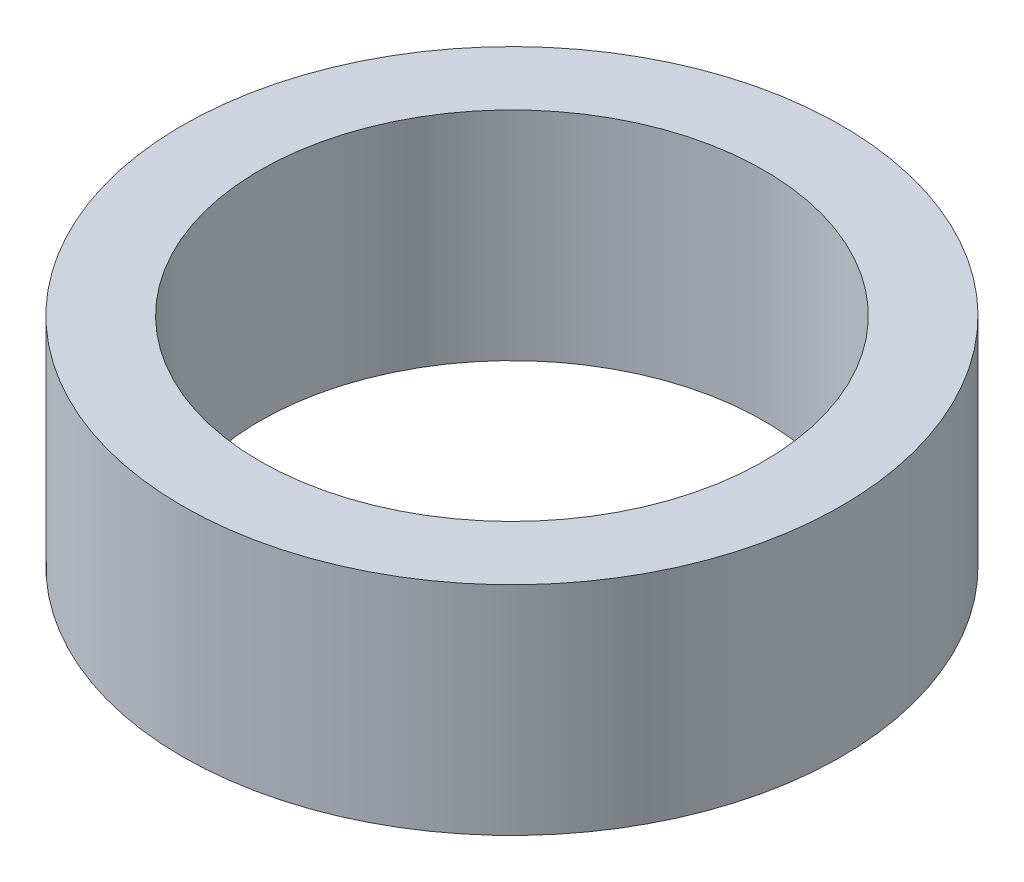
ISO-10303-21;
HEADER;
FILE_DESCRIPTION(('STEP AP214'),'2;1');
FILE_NAME('part.step','',(''),(''),'','','');
FILE_SCHEMA(('AUTOMOTIVE_DESIGN { 1 0 10303 214 1 1 1 1 }'));
ENDSEC;
DATA;
#1=APPLICATION_CONTEXT('core data for automotive mechanical design processes');
#2=APPLICATION_PROTOCOL_DEFINITION('international standard','automotive_design',2000,#1);
#3=PRODUCT_CONTEXT('',#1,'mechanical');
#4=PRODUCT('Part','Part','',(#3));
#5=PRODUCT_RELATED_PRODUCT_CATEGORY('part','',(#4));
#6=PRODUCT_DEFINITION_FORMATION('','',#4);
#7=PRODUCT_DEFINITION_CONTEXT('part definition',#1,'design');
#8=PRODUCT_DEFINITION('design','',#6,#7);
#9=PRODUCT_DEFINITION_SHAPE('','',#8);
#10=(LENGTH_UNIT() NAMED_UNIT(*) SI_UNIT(.MILLI.,.METRE.));
#11=(NAMED_UNIT(*) PLANE_ANGLE_UNIT() SI_UNIT($,.RADIAN.));
#12=(NAMED_UNIT(*) SI_UNIT($,.STERADIAN.) SOLID_ANGLE_UNIT());
#13=UNCERTAINTY_MEASURE_WITH_UNIT(LENGTH_MEASURE(1.E-05),#10,'distance_accuracy_value','');
#14=(GEOMETRIC_REPRESENTATION_CONTEXT(3) GLOBAL_UNCERTAINTY_ASSIGNED_CONTEXT((#13)) GLOBAL_UNIT_ASSIGNED_CONTEXT((#10,
#11,#12)) REPRESENTATION_CONTEXT('',''));
#15=CARTESIAN_POINT('',(0.,0.,0.));
#16=DIRECTION('',(0.,0.,1.));
#17=DIRECTION('',(1.,0.,0.));
#18=AXIS2_PLACEMENT_3D('',#15,#16,#17);
#19=CARTESIAN_POINT('',(0.,28.,0.));
#20=DIRECTION('',(0.,-1.,0.));
#21=DIRECTION('',(0.,0.,-1.));
#22=AXIS2_PLACEMENT_3D('',#19,#20,#21);
#23=CYLINDRICAL_SURFACE('',#22,42.5);
#24=CARTESIAN_POINT('',(0.,28.,0.));
#25=DIRECTION('',(0.,1.,0.));
#26=DIRECTION('',(0.,0.,1.));
#27=AXIS2_PLACEMENT_3D('',#24,#25,#26);
#28=CIRCLE('',#27,42.5);
#29=CARTESIAN_POINT('',(0.,28.,42.5));
#30=VERTEX_POINT('',#29);
#31=EDGE_CURVE('E10',#30,#30,#28,.T.);
#32=ORIENTED_EDGE('',*,*,#31,.F.);
#33=EDGE_LOOP('',(#32));
#34=FACE_BOUND('',#33,.T.);
#35=CARTESIAN_POINT('',(0.,0.,0.));
#36=DIRECTION('',(0.,1.,0.));
#37=DIRECTION('',(0.,0.,1.));
#38=AXIS2_PLACEMENT_3D('',#35,#36,#37);
#39=CIRCLE('',#38,42.5);
#40=CARTESIAN_POINT('',(0.,0.,42.5));
#41=VERTEX_POINT('',#40);
#42=EDGE_CURVE('E37',#41,#41,#39,.T.);
#43=ORIENTED_EDGE('',*,*,#42,.T.);
#44=EDGE_LOOP('',(#43));
#45=FACE_BOUND('',#44,.T.);
#46=ADVANCED_FACE('F40',(#34,#45),#23,.T.);
#47=CARTESIAN_POINT('',(0.,28.,0.));
#48=DIRECTION('',(0.,1.,0.));
#49=DIRECTION('',(0.,0.,1.));
#50=AXIS2_PLACEMENT_3D('',#47,#48,#49);
#51=PLANE('',#50);
#52=CARTESIAN_POINT('',(0.,28.,0.));
#53=DIRECTION('',(0.,1.,0.));
#54=DIRECTION('',(0.,0.,1.));
#55=AXIS2_PLACEMENT_3D('',#52,#53,#54);
#56=CIRCLE('',#55,32.5);
#57=CARTESIAN_POINT('',(0.,28.,32.5));
#58=VERTEX_POINT('',#57);
#59=EDGE_CURVE('E50',#58,#58,#56,.T.);
#60=ORIENTED_EDGE('',*,*,#59,.F.);
#61=EDGE_LOOP('',(#60));
#62=FACE_BOUND('',#61,.T.);
#63=ORIENTED_EDGE('',*,*,#31,.T.);
#64=EDGE_LOOP('',(#63));
#65=FACE_BOUND('',#64,.T.);
#66=ADVANCED_FACE('F59',(#62,#65),#51,.T.);
#67=CARTESIAN_POINT('',(0.,0.,0.));
#68=DIRECTION('',(0.,1.,0.));
#69=DIRECTION('',(0.,0.,1.));
#70=AXIS2_PLACEMENT_3D('',#67,#68,#69);
#71=PLANE('',#70);
#72=CARTESIAN_POINT('',(0.,0.,0.));
#73=DIRECTION('',(0.,1.,0.));
#74=DIRECTION('',(0.,0.,1.));
#75=AXIS2_PLACEMENT_3D('',#72,#73,#74);
#76=CIRCLE('',#75,32.5);
#77=CARTESIAN_POINT('',(0.,0.,32.5));
#78=VERTEX_POINT('',#77);
#79=EDGE_CURVE('E47',#78,#78,#76,.T.);
#80=ORIENTED_EDGE('',*,*,#79,.T.);
#81=EDGE_LOOP('',(#80));
#82=FACE_BOUND('',#81,.T.);
#83=ORIENTED_EDGE('',*,*,#42,.F.);
#84=EDGE_LOOP('',(#83));
#85=FACE_BOUND('',#84,.T.);
#86=ADVANCED_FACE('F58',(#82,#85),#71,.F.);
#87=CARTESIAN_POINT('',(0.,28.,0.));
#88=DIRECTION('',(0.,-1.,0.));
#89=DIRECTION('',(0.,0.,-1.));
#90=AXIS2_PLACEMENT_3D('',#87,#88,#89);
#91=CYLINDRICAL_SURFACE('',#90,32.5);
#92=ORIENTED_EDGE('',*,*,#59,.T.);
#93=EDGE_LOOP('',(#92));
#94=FACE_BOUND('',#93,.T.);
#95=ORIENTED_EDGE('',*,*,#79,.F.);
#96=EDGE_LOOP('',(#95));
#97=FACE_BOUND('',#96,.T.);
#98=ADVANCED_FACE('F54',(#94,#97),#91,.F.);
#99=CLOSED_SHELL('',(#46,#66,#86,#98));
#100=MANIFOLD_SOLID_BREP('B2',#99);
#101=ADVANCED_BREP_SHAPE_REPRESENTATION('',(#18,#100),#14);
#102=SHAPE_DEFINITION_REPRESENTATION(#9,#101);
ENDSEC;
END-ISO-10303-21;
